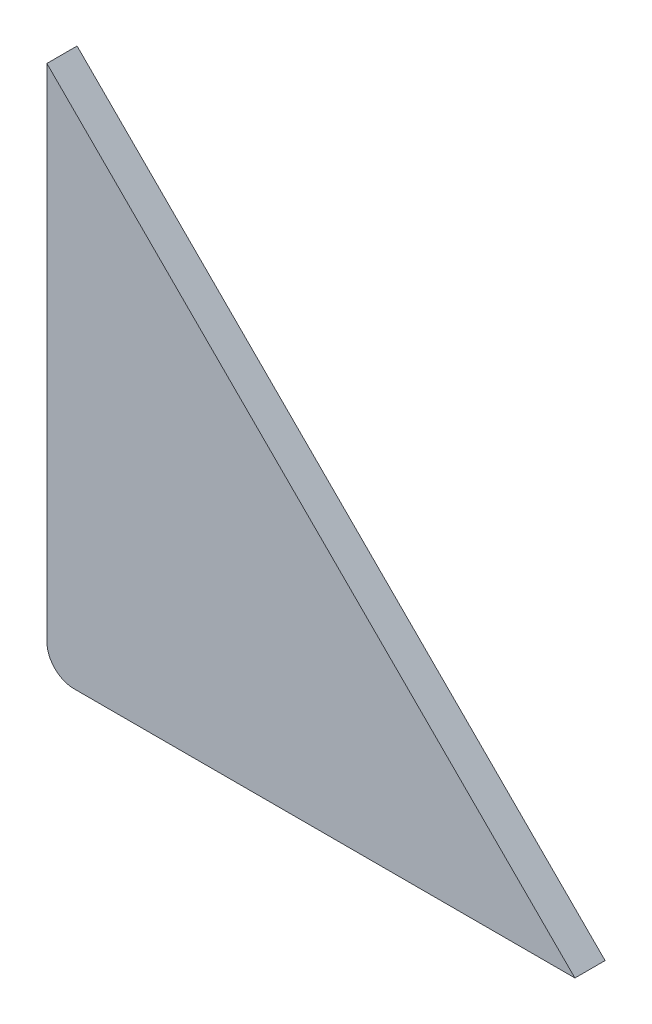
ISO-10303-21;
HEADER;
FILE_DESCRIPTION(('STEP AP214'),'2;1');
FILE_NAME('part.step','',(''),(''),'','','');
FILE_SCHEMA(('AUTOMOTIVE_DESIGN { 1 0 10303 214 1 1 1 1 }'));
ENDSEC;
DATA;
#1=APPLICATION_CONTEXT('core data for automotive mechanical design processes');
#2=APPLICATION_PROTOCOL_DEFINITION('international standard','automotive_design',2000,#1);
#3=PRODUCT_CONTEXT('',#1,'mechanical');
#4=PRODUCT('Part','Part','',(#3));
#5=PRODUCT_RELATED_PRODUCT_CATEGORY('part','',(#4));
#6=PRODUCT_DEFINITION_FORMATION('','',#4);
#7=PRODUCT_DEFINITION_CONTEXT('part definition',#1,'design');
#8=PRODUCT_DEFINITION('design','',#6,#7);
#9=PRODUCT_DEFINITION_SHAPE('','',#8);
#10=(LENGTH_UNIT() NAMED_UNIT(*) SI_UNIT(.MILLI.,.METRE.));
#11=(NAMED_UNIT(*) PLANE_ANGLE_UNIT() SI_UNIT($,.RADIAN.));
#12=(NAMED_UNIT(*) SI_UNIT($,.STERADIAN.) SOLID_ANGLE_UNIT());
#13=UNCERTAINTY_MEASURE_WITH_UNIT(LENGTH_MEASURE(1.E-05),#10,'distance_accuracy_value','');
#14=(GEOMETRIC_REPRESENTATION_CONTEXT(3) GLOBAL_UNCERTAINTY_ASSIGNED_CONTEXT((#13)) GLOBAL_UNIT_ASSIGNED_CONTEXT((#10,
#11,#12)) REPRESENTATION_CONTEXT('',''));
#15=CARTESIAN_POINT('',(0.,0.,0.));
#16=DIRECTION('',(0.,0.,1.));
#17=DIRECTION('',(1.,0.,0.));
#18=AXIS2_PLACEMENT_3D('',#15,#16,#17);
#19=CARTESIAN_POINT('',(0.,35.,2.));
#20=DIRECTION('',(-0.707106781186547,-0.707106781186547,0.));
#21=DIRECTION('',(0.707106781186548,-0.707106781186548,0.));
#22=AXIS2_PLACEMENT_3D('',#19,#20,#21);
#23=PLANE('',#22);
#24=DIRECTION('',(-0.707106781186548,0.707106781186548,0.));
#25=VECTOR('',#24,1.);
#26=CARTESIAN_POINT('',(0.,35.,0.));
#27=LINE('',#26,#25);
#28=CARTESIAN_POINT('',(35.,0.,0.));
#29=VERTEX_POINT('',#28);
#30=CARTESIAN_POINT('',(0.,35.,0.));
#31=VERTEX_POINT('',#30);
#32=EDGE_CURVE('E102',#29,#31,#27,.T.);
#33=ORIENTED_EDGE('',*,*,#32,.T.);
#34=DIRECTION('',(0.,0.,-1.));
#35=VECTOR('',#34,1.);
#36=CARTESIAN_POINT('',(0.,35.,2.));
#37=LINE('',#36,#35);
#38=CARTESIAN_POINT('',(0.,35.,2.));
#39=VERTEX_POINT('',#38);
#40=EDGE_CURVE('E11',#39,#31,#37,.T.);
#41=ORIENTED_EDGE('',*,*,#40,.F.);
#42=DIRECTION('',(-0.707106781186548,0.707106781186548,0.));
#43=VECTOR('',#42,1.);
#44=CARTESIAN_POINT('',(0.,35.,2.));
#45=LINE('',#44,#43);
#46=CARTESIAN_POINT('',(35.,0.,2.));
#47=VERTEX_POINT('',#46);
#48=EDGE_CURVE('E90',#47,#39,#45,.T.);
#49=ORIENTED_EDGE('',*,*,#48,.F.);
#50=DIRECTION('',(0.,0.,-1.));
#51=VECTOR('',#50,1.);
#52=CARTESIAN_POINT('',(35.,0.,2.));
#53=LINE('',#52,#51);
#54=EDGE_CURVE('E98',#47,#29,#53,.T.);
#55=ORIENTED_EDGE('',*,*,#54,.T.);
#56=EDGE_LOOP('',(#33,#41,#49,#55));
#57=FACE_BOUND('',#56,.T.);
#58=ADVANCED_FACE('F39',(#57),#23,.F.);
#59=CARTESIAN_POINT('',(0.,1.8,2.));
#60=DIRECTION('',(1.,0.,0.));
#61=DIRECTION('',(0.,1.,0.));
#62=AXIS2_PLACEMENT_3D('',#59,#60,#61);
#63=PLANE('',#62);
#64=DIRECTION('',(0.,-1.,0.));
#65=VECTOR('',#64,1.);
#66=CARTESIAN_POINT('',(0.,1.8,0.));
#67=LINE('',#66,#65);
#68=CARTESIAN_POINT('',(0.,1.8,0.));
#69=VERTEX_POINT('',#68);
#70=EDGE_CURVE('E94',#31,#69,#67,.T.);
#71=ORIENTED_EDGE('',*,*,#70,.T.);
#72=DIRECTION('',(0.,0.,-1.));
#73=VECTOR('',#72,1.);
#74=CARTESIAN_POINT('',(0.,1.8,2.));
#75=LINE('',#74,#73);
#76=CARTESIAN_POINT('',(0.,1.8,2.));
#77=VERTEX_POINT('',#76);
#78=EDGE_CURVE('E47',#77,#69,#75,.T.);
#79=ORIENTED_EDGE('',*,*,#78,.F.);
#80=DIRECTION('',(0.,-1.,0.));
#81=VECTOR('',#80,1.);
#82=CARTESIAN_POINT('',(0.,1.8,2.));
#83=LINE('',#82,#81);
#84=EDGE_CURVE('E85',#39,#77,#83,.T.);
#85=ORIENTED_EDGE('',*,*,#84,.F.);
#86=ORIENTED_EDGE('',*,*,#40,.T.);
#87=EDGE_LOOP('',(#71,#79,#85,#86));
#88=FACE_BOUND('',#87,.T.);
#89=ADVANCED_FACE('F93',(#88),#63,.F.);
#90=CARTESIAN_POINT('',(1.8,1.8,2.));
#91=DIRECTION('',(0.,0.,-1.));
#92=DIRECTION('',(-1.,0.,0.));
#93=AXIS2_PLACEMENT_3D('',#90,#91,#92);
#94=CYLINDRICAL_SURFACE('',#93,1.8);
#95=CARTESIAN_POINT('',(1.8,1.8,0.));
#96=DIRECTION('',(0.,0.,1.));
#97=DIRECTION('',(1.,0.,0.));
#98=AXIS2_PLACEMENT_3D('',#95,#96,#97);
#99=CIRCLE('',#98,1.8);
#100=CARTESIAN_POINT('',(1.8,0.,0.));
#101=VERTEX_POINT('',#100);
#102=EDGE_CURVE('E72',#69,#101,#99,.T.);
#103=ORIENTED_EDGE('',*,*,#102,.T.);
#104=DIRECTION('',(0.,0.,-1.));
#105=VECTOR('',#104,1.);
#106=CARTESIAN_POINT('',(1.8,0.,2.));
#107=LINE('',#106,#105);
#108=CARTESIAN_POINT('',(1.8,0.,2.));
#109=VERTEX_POINT('',#108);
#110=EDGE_CURVE('E95',#109,#101,#107,.T.);
#111=ORIENTED_EDGE('',*,*,#110,.F.);
#112=CARTESIAN_POINT('',(1.8,1.8,2.));
#113=DIRECTION('',(0.,0.,1.));
#114=DIRECTION('',(1.,0.,0.));
#115=AXIS2_PLACEMENT_3D('',#112,#113,#114);
#116=CIRCLE('',#115,1.8);
#117=EDGE_CURVE('E88',#77,#109,#116,.T.);
#118=ORIENTED_EDGE('',*,*,#117,.F.);
#119=ORIENTED_EDGE('',*,*,#78,.T.);
#120=EDGE_LOOP('',(#103,#111,#118,#119));
#121=FACE_BOUND('',#120,.T.);
#122=ADVANCED_FACE('F96',(#121),#94,.T.);
#123=CARTESIAN_POINT('',(35.,0.,2.));
#124=DIRECTION('',(0.,1.,0.));
#125=DIRECTION('',(-1.,0.,0.));
#126=AXIS2_PLACEMENT_3D('',#123,#124,#125);
#127=PLANE('',#126);
#128=DIRECTION('',(1.,0.,0.));
#129=VECTOR('',#128,1.);
#130=CARTESIAN_POINT('',(35.,0.,0.));
#131=LINE('',#130,#129);
#132=EDGE_CURVE('E78',#101,#29,#131,.T.);
#133=ORIENTED_EDGE('',*,*,#132,.T.);
#134=ORIENTED_EDGE('',*,*,#54,.F.);
#135=DIRECTION('',(1.,0.,0.));
#136=VECTOR('',#135,1.);
#137=CARTESIAN_POINT('',(35.,0.,2.));
#138=LINE('',#137,#136);
#139=EDGE_CURVE('E55',#109,#47,#138,.T.);
#140=ORIENTED_EDGE('',*,*,#139,.F.);
#141=ORIENTED_EDGE('',*,*,#110,.T.);
#142=EDGE_LOOP('',(#133,#134,#140,#141));
#143=FACE_BOUND('',#142,.T.);
#144=ADVANCED_FACE('F109',(#143),#127,.F.);
#145=CARTESIAN_POINT('',(1.8,1.8,2.));
#146=DIRECTION('',(0.,0.,1.));
#147=DIRECTION('',(1.,0.,0.));
#148=AXIS2_PLACEMENT_3D('',#145,#146,#147);
#149=PLANE('',#148);
#150=ORIENTED_EDGE('',*,*,#48,.T.);
#151=ORIENTED_EDGE('',*,*,#84,.T.);
#152=ORIENTED_EDGE('',*,*,#117,.T.);
#153=ORIENTED_EDGE('',*,*,#139,.T.);
#154=EDGE_LOOP('',(#150,#151,#152,#153));
#155=FACE_BOUND('',#154,.T.);
#156=ADVANCED_FACE('F86',(#155),#149,.T.);
#157=CARTESIAN_POINT('',(1.8,1.8,0.));
#158=DIRECTION('',(0.,0.,1.));
#159=DIRECTION('',(1.,0.,0.));
#160=AXIS2_PLACEMENT_3D('',#157,#158,#159);
#161=PLANE('',#160);
#162=ORIENTED_EDGE('',*,*,#32,.F.);
#163=ORIENTED_EDGE('',*,*,#132,.F.);
#164=ORIENTED_EDGE('',*,*,#102,.F.);
#165=ORIENTED_EDGE('',*,*,#70,.F.);
#166=EDGE_LOOP('',(#162,#163,#164,#165));
#167=FACE_BOUND('',#166,.T.);
#168=ADVANCED_FACE('F112',(#167),#161,.F.);
#169=CLOSED_SHELL('',(#58,#89,#122,#144,#156,#168));
#170=MANIFOLD_SOLID_BREP('B2',#169);
#171=ADVANCED_BREP_SHAPE_REPRESENTATION('',(#18,#170),#14);
#172=SHAPE_DEFINITION_REPRESENTATION(#9,#171);
ENDSEC;
END-ISO-10303-21;
